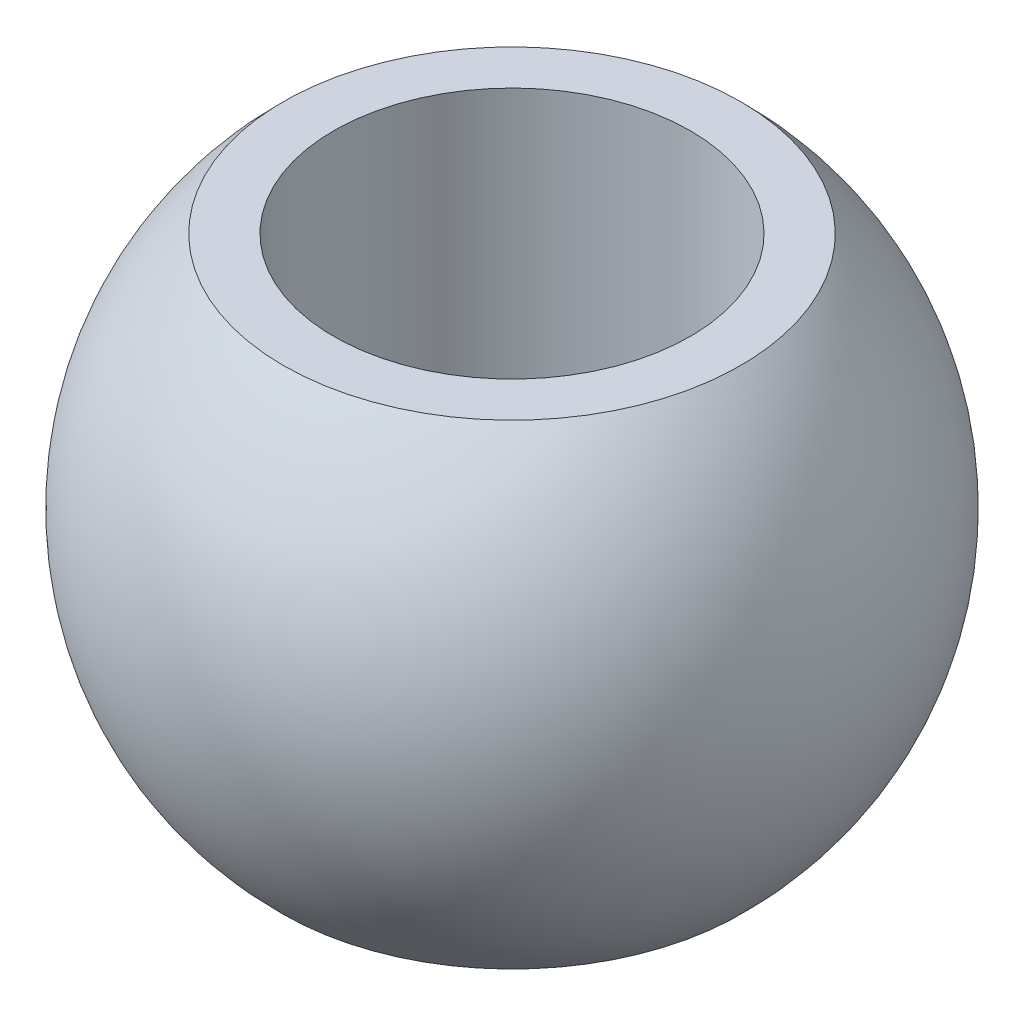
ISO-10303-21;
HEADER;
FILE_DESCRIPTION(('STEP AP214'),'2;1');
FILE_NAME('part.step','',(''),(''),'','','');
FILE_SCHEMA(('AUTOMOTIVE_DESIGN { 1 0 10303 214 1 1 1 1 }'));
ENDSEC;
DATA;
#1=APPLICATION_CONTEXT('core data for automotive mechanical design processes');
#2=APPLICATION_PROTOCOL_DEFINITION('international standard','automotive_design',2000,#1);
#3=PRODUCT_CONTEXT('',#1,'mechanical');
#4=PRODUCT('Part','Part','',(#3));
#5=PRODUCT_RELATED_PRODUCT_CATEGORY('part','',(#4));
#6=PRODUCT_DEFINITION_FORMATION('','',#4);
#7=PRODUCT_DEFINITION_CONTEXT('part definition',#1,'design');
#8=PRODUCT_DEFINITION('design','',#6,#7);
#9=PRODUCT_DEFINITION_SHAPE('','',#8);
#10=(LENGTH_UNIT() NAMED_UNIT(*) SI_UNIT(.MILLI.,.METRE.));
#11=(NAMED_UNIT(*) PLANE_ANGLE_UNIT() SI_UNIT($,.RADIAN.));
#12=(NAMED_UNIT(*) SI_UNIT($,.STERADIAN.) SOLID_ANGLE_UNIT());
#13=UNCERTAINTY_MEASURE_WITH_UNIT(LENGTH_MEASURE(1.E-05),#10,'distance_accuracy_value','');
#14=(GEOMETRIC_REPRESENTATION_CONTEXT(3) GLOBAL_UNCERTAINTY_ASSIGNED_CONTEXT((#13)) GLOBAL_UNIT_ASSIGNED_CONTEXT((#10,
#11,#12)) REPRESENTATION_CONTEXT('',''));
#15=CARTESIAN_POINT('',(0.,0.,0.));
#16=DIRECTION('',(0.,0.,1.));
#17=DIRECTION('',(1.,0.,0.));
#18=AXIS2_PLACEMENT_3D('',#15,#16,#17);
#19=CARTESIAN_POINT('',(6.,-8.,0.));
#20=DIRECTION('',(0.,-1.,0.));
#21=DIRECTION('',(0.,0.,-1.));
#22=AXIS2_PLACEMENT_3D('',#19,#20,#21);
#23=PLANE('',#22);
#24=CARTESIAN_POINT('',(0.,-8.,0.));
#25=DIRECTION('',(0.,-1.,0.));
#26=DIRECTION('',(0.,0.,-1.));
#27=AXIS2_PLACEMENT_3D('',#24,#25,#26);
#28=CIRCLE('',#27,7.69480344128425);
#29=CARTESIAN_POINT('',(0.,-8.,-7.69480344128425));
#30=VERTEX_POINT('',#29);
#31=EDGE_CURVE('E10',#30,#30,#28,.T.);
#32=ORIENTED_EDGE('',*,*,#31,.T.);
#33=EDGE_LOOP('',(#32));
#34=FACE_BOUND('',#33,.T.);
#35=CARTESIAN_POINT('',(0.,-8.,0.));
#36=DIRECTION('',(0.,-1.,0.));
#37=DIRECTION('',(0.,0.,-1.));
#38=AXIS2_PLACEMENT_3D('',#35,#36,#37);
#39=CIRCLE('',#38,6.);
#40=CARTESIAN_POINT('',(0.,-8.,-6.));
#41=VERTEX_POINT('',#40);
#42=EDGE_CURVE('E45',#41,#41,#39,.T.);
#43=ORIENTED_EDGE('',*,*,#42,.F.);
#44=EDGE_LOOP('',(#43));
#45=FACE_BOUND('',#44,.T.);
#46=ADVANCED_FACE('F31',(#34,#45),#23,.T.);
#47=CARTESIAN_POINT('',(0.,0.,0.));
#48=DIRECTION('',(0.,-1.,0.));
#49=DIRECTION('',(1.,0.,0.));
#50=AXIS2_PLACEMENT_3D('',#47,#48,#49);
#51=SPHERICAL_SURFACE('',#50,11.1);
#52=CARTESIAN_POINT('',(0.,8.,0.));
#53=DIRECTION('',(0.,-1.,0.));
#54=DIRECTION('',(0.,0.,-1.));
#55=AXIS2_PLACEMENT_3D('',#52,#53,#54);
#56=CIRCLE('',#55,7.69480344128425);
#57=CARTESIAN_POINT('',(0.,8.,-7.69480344128425));
#58=VERTEX_POINT('',#57);
#59=EDGE_CURVE('E37',#58,#58,#56,.T.);
#60=ORIENTED_EDGE('',*,*,#59,.T.);
#61=EDGE_LOOP('',(#60));
#62=FACE_BOUND('',#61,.T.);
#63=ORIENTED_EDGE('',*,*,#31,.F.);
#64=EDGE_LOOP('',(#63));
#65=FACE_BOUND('',#64,.T.);
#66=ADVANCED_FACE('F55',(#62,#65),#51,.T.);
#67=CARTESIAN_POINT('',(6.,8.,0.));
#68=DIRECTION('',(0.,1.,0.));
#69=DIRECTION('',(0.,0.,1.));
#70=AXIS2_PLACEMENT_3D('',#67,#68,#69);
#71=PLANE('',#70);
#72=CARTESIAN_POINT('',(0.,8.,0.));
#73=DIRECTION('',(0.,-1.,0.));
#74=DIRECTION('',(0.,0.,-1.));
#75=AXIS2_PLACEMENT_3D('',#72,#73,#74);
#76=CIRCLE('',#75,6.);
#77=CARTESIAN_POINT('',(0.,8.,-6.));
#78=VERTEX_POINT('',#77);
#79=EDGE_CURVE('E41',#78,#78,#76,.T.);
#80=ORIENTED_EDGE('',*,*,#79,.T.);
#81=EDGE_LOOP('',(#80));
#82=FACE_BOUND('',#81,.T.);
#83=ORIENTED_EDGE('',*,*,#59,.F.);
#84=EDGE_LOOP('',(#83));
#85=FACE_BOUND('',#84,.T.);
#86=ADVANCED_FACE('F59',(#82,#85),#71,.T.);
#87=CARTESIAN_POINT('',(0.,-11.1,0.));
#88=DIRECTION('',(0.,-1.,0.));
#89=DIRECTION('',(0.,0.,-1.));
#90=AXIS2_PLACEMENT_3D('',#87,#88,#89);
#91=CYLINDRICAL_SURFACE('',#90,6.);
#92=ORIENTED_EDGE('',*,*,#42,.T.);
#93=EDGE_LOOP('',(#92));
#94=FACE_BOUND('',#93,.T.);
#95=ORIENTED_EDGE('',*,*,#79,.F.);
#96=EDGE_LOOP('',(#95));
#97=FACE_BOUND('',#96,.T.);
#98=ADVANCED_FACE('F51',(#94,#97),#91,.F.);
#99=CLOSED_SHELL('',(#46,#66,#86,#98));
#100=MANIFOLD_SOLID_BREP('B2',#99);
#101=ADVANCED_BREP_SHAPE_REPRESENTATION('',(#18,#100),#14);
#102=SHAPE_DEFINITION_REPRESENTATION(#9,#101);
ENDSEC;
END-ISO-10303-21;
